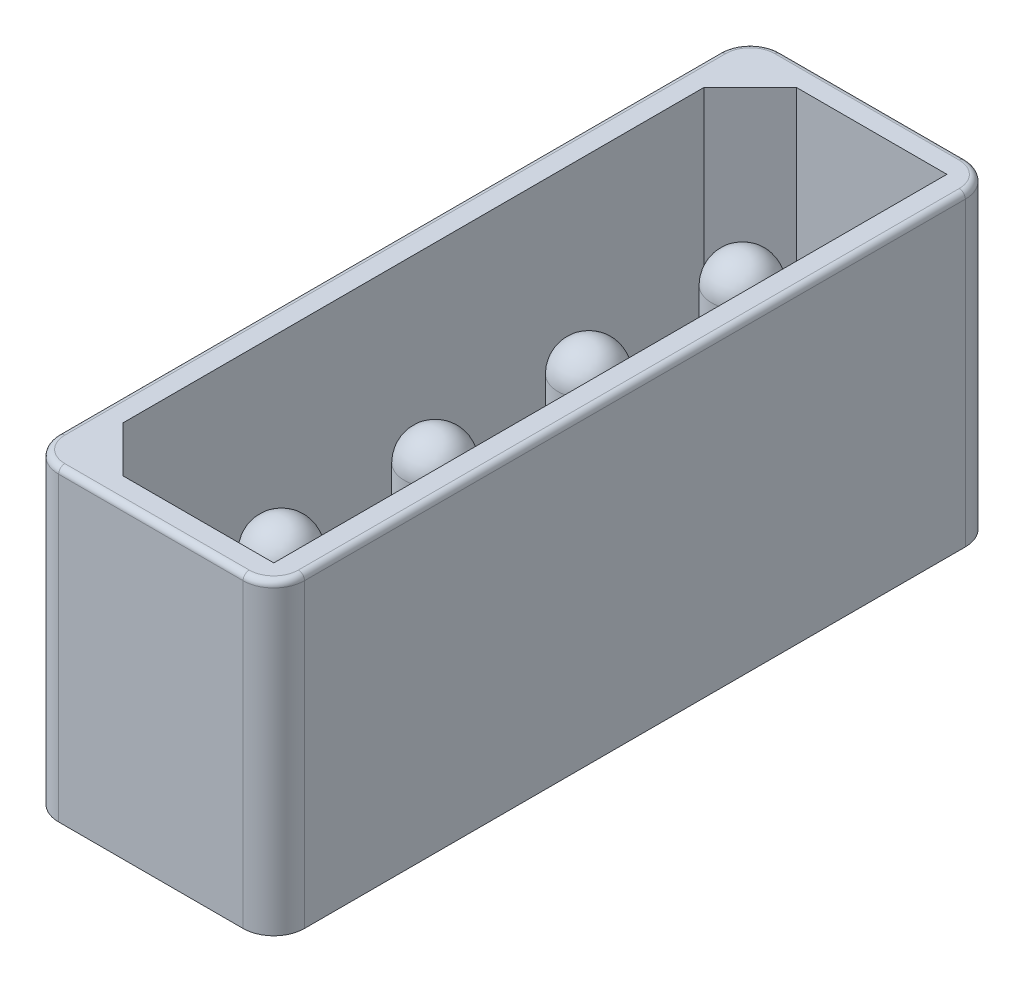
ISO-10303-21;
HEADER;
FILE_DESCRIPTION(('STEP AP214'),'2;1');
FILE_NAME('part.step','',(''),(''),'','','');
FILE_SCHEMA(('AUTOMOTIVE_DESIGN { 1 0 10303 214 1 1 1 1 }'));
ENDSEC;
DATA;
#1=APPLICATION_CONTEXT('core data for automotive mechanical design processes');
#2=APPLICATION_PROTOCOL_DEFINITION('international standard','automotive_design',2000,#1);
#3=PRODUCT_CONTEXT('',#1,'mechanical');
#4=PRODUCT('Part','Part','',(#3));
#5=PRODUCT_RELATED_PRODUCT_CATEGORY('part','',(#4));
#6=PRODUCT_DEFINITION_FORMATION('','',#4);
#7=PRODUCT_DEFINITION_CONTEXT('part definition',#1,'design');
#8=PRODUCT_DEFINITION('design','',#6,#7);
#9=PRODUCT_DEFINITION_SHAPE('','',#8);
#10=(LENGTH_UNIT() NAMED_UNIT(*) SI_UNIT(.MILLI.,.METRE.));
#11=(NAMED_UNIT(*) PLANE_ANGLE_UNIT() SI_UNIT($,.RADIAN.));
#12=(NAMED_UNIT(*) SI_UNIT($,.STERADIAN.) SOLID_ANGLE_UNIT());
#13=UNCERTAINTY_MEASURE_WITH_UNIT(LENGTH_MEASURE(1.E-05),#10,'distance_accuracy_value','');
#14=(GEOMETRIC_REPRESENTATION_CONTEXT(3) GLOBAL_UNCERTAINTY_ASSIGNED_CONTEXT((#13)) GLOBAL_UNIT_ASSIGNED_CONTEXT((#10,
#11,#12)) REPRESENTATION_CONTEXT('',''));
#15=CARTESIAN_POINT('',(0.,0.,0.));
#16=DIRECTION('',(0.,0.,1.));
#17=DIRECTION('',(1.,0.,0.));
#18=AXIS2_PLACEMENT_3D('',#15,#16,#17);
#19=CARTESIAN_POINT('',(-3.,1.5,10.75));
#20=DIRECTION('',(0.,-1.,0.));
#21=DIRECTION('',(0.,0.,-1.));
#22=AXIS2_PLACEMENT_3D('',#19,#20,#21);
#23=CYLINDRICAL_SURFACE('',#22,1.);
#24=CARTESIAN_POINT('',(-3.,1.,10.75));
#25=DIRECTION('',(0.,-1.,0.));
#26=DIRECTION('',(0.,0.,-1.));
#27=AXIS2_PLACEMENT_3D('',#24,#25,#26);
#28=CIRCLE('',#27,1.);
#29=CARTESIAN_POINT('',(-3.,1.,11.75));
#30=VERTEX_POINT('',#29);
#31=CARTESIAN_POINT('',(-4.,1.,10.75));
#32=VERTEX_POINT('',#31);
#33=EDGE_CURVE('E290',#30,#32,#28,.T.);
#34=ORIENTED_EDGE('',*,*,#33,.F.);
#35=DIRECTION('',(0.,-1.,0.));
#36=VECTOR('',#35,1.);
#37=CARTESIAN_POINT('',(-3.,1.5,11.75));
#38=LINE('',#37,#36);
#39=CARTESIAN_POINT('',(-3.,10.8,11.75));
#40=VERTEX_POINT('',#39);
#41=EDGE_CURVE('E12',#40,#30,#38,.T.);
#42=ORIENTED_EDGE('',*,*,#41,.F.);
#43=CARTESIAN_POINT('',(-3.,10.8,10.75));
#44=DIRECTION('',(0.,1.,0.));
#45=DIRECTION('',(0.,0.,1.));
#46=AXIS2_PLACEMENT_3D('',#43,#44,#45);
#47=CIRCLE('',#46,1.);
#48=CARTESIAN_POINT('',(-4.,10.8,10.75));
#49=VERTEX_POINT('',#48);
#50=EDGE_CURVE('E237',#40,#49,#47,.F.);
#51=ORIENTED_EDGE('',*,*,#50,.T.);
#52=DIRECTION('',(0.,-1.,0.));
#53=VECTOR('',#52,1.);
#54=CARTESIAN_POINT('',(-4.,1.5,10.75));
#55=LINE('',#54,#53);
#56=EDGE_CURVE('E52',#49,#32,#55,.T.);
#57=ORIENTED_EDGE('',*,*,#56,.T.);
#58=EDGE_LOOP('',(#34,#42,#51,#57));
#59=FACE_BOUND('',#58,.T.);
#60=ADVANCED_FACE('F49',(#59),#23,.T.);
#61=CARTESIAN_POINT('',(3.,1.5,11.75));
#62=DIRECTION('',(0.,0.,1.));
#63=DIRECTION('',(1.,0.,0.));
#64=AXIS2_PLACEMENT_3D('',#61,#62,#63);
#65=PLANE('',#64);
#66=DIRECTION('',(-1.,0.,0.));
#67=VECTOR('',#66,1.);
#68=CARTESIAN_POINT('',(3.,1.,11.75));
#69=LINE('',#68,#67);
#70=CARTESIAN_POINT('',(3.,1.,11.75));
#71=VERTEX_POINT('',#70);
#72=EDGE_CURVE('E311',#71,#30,#69,.T.);
#73=ORIENTED_EDGE('',*,*,#72,.F.);
#74=DIRECTION('',(0.,-1.,0.));
#75=VECTOR('',#74,1.);
#76=CARTESIAN_POINT('',(3.,1.5,11.75));
#77=LINE('',#76,#75);
#78=CARTESIAN_POINT('',(3.,10.8,11.75));
#79=VERTEX_POINT('',#78);
#80=EDGE_CURVE('E57',#79,#71,#77,.T.);
#81=ORIENTED_EDGE('',*,*,#80,.F.);
#82=DIRECTION('',(1.,0.,0.));
#83=VECTOR('',#82,1.);
#84=CARTESIAN_POINT('',(-3.,10.8,11.75));
#85=LINE('',#84,#83);
#86=EDGE_CURVE('E258',#79,#40,#85,.F.);
#87=ORIENTED_EDGE('',*,*,#86,.T.);
#88=ORIENTED_EDGE('',*,*,#41,.T.);
#89=EDGE_LOOP('',(#73,#81,#87,#88));
#90=FACE_BOUND('',#89,.T.);
#91=ADVANCED_FACE('F335',(#90),#65,.T.);
#92=CARTESIAN_POINT('',(3.,1.5,10.75));
#93=DIRECTION('',(0.,-1.,0.));
#94=DIRECTION('',(0.,0.,-1.));
#95=AXIS2_PLACEMENT_3D('',#92,#93,#94);
#96=CYLINDRICAL_SURFACE('',#95,1.);
#97=CARTESIAN_POINT('',(3.,1.,10.75));
#98=DIRECTION('',(0.,-1.,0.));
#99=DIRECTION('',(0.,0.,-1.));
#100=AXIS2_PLACEMENT_3D('',#97,#98,#99);
#101=CIRCLE('',#100,1.);
#102=CARTESIAN_POINT('',(4.,1.,10.75));
#103=VERTEX_POINT('',#102);
#104=EDGE_CURVE('E308',#103,#71,#101,.T.);
#105=ORIENTED_EDGE('',*,*,#104,.F.);
#106=DIRECTION('',(0.,-1.,0.));
#107=VECTOR('',#106,1.);
#108=CARTESIAN_POINT('',(4.,1.5,10.75));
#109=LINE('',#108,#107);
#110=CARTESIAN_POINT('',(4.,10.8,10.75));
#111=VERTEX_POINT('',#110);
#112=EDGE_CURVE('E315',#111,#103,#109,.T.);
#113=ORIENTED_EDGE('',*,*,#112,.F.);
#114=CARTESIAN_POINT('',(3.,10.8,10.75));
#115=DIRECTION('',(0.,1.,0.));
#116=DIRECTION('',(0.,0.,1.));
#117=AXIS2_PLACEMENT_3D('',#114,#115,#116);
#118=CIRCLE('',#117,1.);
#119=EDGE_CURVE('E255',#111,#79,#118,.F.);
#120=ORIENTED_EDGE('',*,*,#119,.T.);
#121=ORIENTED_EDGE('',*,*,#80,.T.);
#122=EDGE_LOOP('',(#105,#113,#120,#121));
#123=FACE_BOUND('',#122,.T.);
#124=ADVANCED_FACE('F382',(#123),#96,.T.);
#125=CARTESIAN_POINT('',(3.99999999999999,1.5,-10.75));
#126=DIRECTION('',(1.,0.,0.));
#127=DIRECTION('',(0.,0.,-1.));
#128=AXIS2_PLACEMENT_3D('',#125,#126,#127);
#129=PLANE('',#128);
#130=DIRECTION('',(0.,0.,1.));
#131=VECTOR('',#130,1.);
#132=CARTESIAN_POINT('',(3.99999999999999,1.,-10.75));
#133=LINE('',#132,#131);
#134=CARTESIAN_POINT('',(3.99999999999999,1.,-10.75));
#135=VERTEX_POINT('',#134);
#136=EDGE_CURVE('E305',#135,#103,#133,.T.);
#137=ORIENTED_EDGE('',*,*,#136,.F.);
#138=DIRECTION('',(0.,-1.,0.));
#139=VECTOR('',#138,1.);
#140=CARTESIAN_POINT('',(3.99999999999999,1.5,-10.75));
#141=LINE('',#140,#139);
#142=CARTESIAN_POINT('',(3.99999999999999,10.8,-10.75));
#143=VERTEX_POINT('',#142);
#144=EDGE_CURVE('E317',#143,#135,#141,.T.);
#145=ORIENTED_EDGE('',*,*,#144,.F.);
#146=DIRECTION('',(0.,0.,-1.));
#147=VECTOR('',#146,1.);
#148=CARTESIAN_POINT('',(4.,10.8,10.75));
#149=LINE('',#148,#147);
#150=EDGE_CURVE('E252',#143,#111,#149,.F.);
#151=ORIENTED_EDGE('',*,*,#150,.T.);
#152=ORIENTED_EDGE('',*,*,#112,.T.);
#153=EDGE_LOOP('',(#137,#145,#151,#152));
#154=FACE_BOUND('',#153,.T.);
#155=ADVANCED_FACE('F379',(#154),#129,.T.);
#156=CARTESIAN_POINT('',(2.99999999999999,1.5,-10.75));
#157=DIRECTION('',(0.,-1.,0.));
#158=DIRECTION('',(0.,0.,-1.));
#159=AXIS2_PLACEMENT_3D('',#156,#157,#158);
#160=CYLINDRICAL_SURFACE('',#159,1.);
#161=CARTESIAN_POINT('',(2.99999999999999,1.,-10.75));
#162=DIRECTION('',(0.,-1.,0.));
#163=DIRECTION('',(0.,0.,-1.));
#164=AXIS2_PLACEMENT_3D('',#161,#162,#163);
#165=CIRCLE('',#164,1.);
#166=CARTESIAN_POINT('',(2.99999999999999,1.,-11.75));
#167=VERTEX_POINT('',#166);
#168=EDGE_CURVE('E302',#167,#135,#165,.T.);
#169=ORIENTED_EDGE('',*,*,#168,.F.);
#170=DIRECTION('',(0.,-1.,0.));
#171=VECTOR('',#170,1.);
#172=CARTESIAN_POINT('',(2.99999999999999,1.5,-11.75));
#173=LINE('',#172,#171);
#174=CARTESIAN_POINT('',(2.99999999999999,10.8,-11.75));
#175=VERTEX_POINT('',#174);
#176=EDGE_CURVE('E319',#175,#167,#173,.T.);
#177=ORIENTED_EDGE('',*,*,#176,.F.);
#178=CARTESIAN_POINT('',(2.99999999999999,10.8,-10.75));
#179=DIRECTION('',(0.,1.,0.));
#180=DIRECTION('',(0.,0.,1.));
#181=AXIS2_PLACEMENT_3D('',#178,#179,#180);
#182=CIRCLE('',#181,1.);
#183=EDGE_CURVE('E249',#175,#143,#182,.F.);
#184=ORIENTED_EDGE('',*,*,#183,.T.);
#185=ORIENTED_EDGE('',*,*,#144,.T.);
#186=EDGE_LOOP('',(#169,#177,#184,#185));
#187=FACE_BOUND('',#186,.T.);
#188=ADVANCED_FACE('F376',(#187),#160,.T.);
#189=CARTESIAN_POINT('',(-3.,1.5,-11.75));
#190=DIRECTION('',(0.,0.,-1.));
#191=DIRECTION('',(-1.,0.,0.));
#192=AXIS2_PLACEMENT_3D('',#189,#190,#191);
#193=PLANE('',#192);
#194=DIRECTION('',(1.,0.,0.));
#195=VECTOR('',#194,1.);
#196=CARTESIAN_POINT('',(-3.,1.,-11.75));
#197=LINE('',#196,#195);
#198=CARTESIAN_POINT('',(-3.,1.,-11.75));
#199=VERTEX_POINT('',#198);
#200=EDGE_CURVE('E299',#199,#167,#197,.T.);
#201=ORIENTED_EDGE('',*,*,#200,.F.);
#202=DIRECTION('',(0.,-1.,0.));
#203=VECTOR('',#202,1.);
#204=CARTESIAN_POINT('',(-3.,1.5,-11.75));
#205=LINE('',#204,#203);
#206=CARTESIAN_POINT('',(-3.,10.8,-11.75));
#207=VERTEX_POINT('',#206);
#208=EDGE_CURVE('E321',#207,#199,#205,.T.);
#209=ORIENTED_EDGE('',*,*,#208,.F.);
#210=DIRECTION('',(-1.,0.,0.));
#211=VECTOR('',#210,1.);
#212=CARTESIAN_POINT('',(2.99999999999999,10.8,-11.75));
#213=LINE('',#212,#211);
#214=EDGE_CURVE('E246',#207,#175,#213,.F.);
#215=ORIENTED_EDGE('',*,*,#214,.T.);
#216=ORIENTED_EDGE('',*,*,#176,.T.);
#217=EDGE_LOOP('',(#201,#209,#215,#216));
#218=FACE_BOUND('',#217,.T.);
#219=ADVANCED_FACE('F368',(#218),#193,.T.);
#220=CARTESIAN_POINT('',(-3.,1.5,-10.75));
#221=DIRECTION('',(0.,-1.,0.));
#222=DIRECTION('',(0.,0.,-1.));
#223=AXIS2_PLACEMENT_3D('',#220,#221,#222);
#224=CYLINDRICAL_SURFACE('',#223,1.);
#225=CARTESIAN_POINT('',(-3.,1.,-10.75));
#226=DIRECTION('',(0.,-1.,0.));
#227=DIRECTION('',(0.,0.,-1.));
#228=AXIS2_PLACEMENT_3D('',#225,#226,#227);
#229=CIRCLE('',#228,1.);
#230=CARTESIAN_POINT('',(-4.,1.,-10.75));
#231=VERTEX_POINT('',#230);
#232=EDGE_CURVE('E296',#231,#199,#229,.T.);
#233=ORIENTED_EDGE('',*,*,#232,.F.);
#234=DIRECTION('',(0.,-1.,0.));
#235=VECTOR('',#234,1.);
#236=CARTESIAN_POINT('',(-4.,1.5,-10.75));
#237=LINE('',#236,#235);
#238=CARTESIAN_POINT('',(-4.,10.8,-10.75));
#239=VERTEX_POINT('',#238);
#240=EDGE_CURVE('E322',#239,#231,#237,.T.);
#241=ORIENTED_EDGE('',*,*,#240,.F.);
#242=CARTESIAN_POINT('',(-3.,10.8,-10.75));
#243=DIRECTION('',(0.,1.,0.));
#244=DIRECTION('',(0.,0.,1.));
#245=AXIS2_PLACEMENT_3D('',#242,#243,#244);
#246=CIRCLE('',#245,1.);
#247=EDGE_CURVE('E243',#239,#207,#246,.F.);
#248=ORIENTED_EDGE('',*,*,#247,.T.);
#249=ORIENTED_EDGE('',*,*,#208,.T.);
#250=EDGE_LOOP('',(#233,#241,#248,#249));
#251=FACE_BOUND('',#250,.T.);
#252=ADVANCED_FACE('F360',(#251),#224,.T.);
#253=CARTESIAN_POINT('',(-4.,1.5,10.75));
#254=DIRECTION('',(-1.,0.,0.));
#255=DIRECTION('',(0.,0.,1.));
#256=AXIS2_PLACEMENT_3D('',#253,#254,#255);
#257=PLANE('',#256);
#258=DIRECTION('',(0.,0.,-1.));
#259=VECTOR('',#258,1.);
#260=CARTESIAN_POINT('',(-4.,1.,10.75));
#261=LINE('',#260,#259);
#262=EDGE_CURVE('E293',#32,#231,#261,.T.);
#263=ORIENTED_EDGE('',*,*,#262,.F.);
#264=ORIENTED_EDGE('',*,*,#56,.F.);
#265=DIRECTION('',(0.,0.,1.));
#266=VECTOR('',#265,1.);
#267=CARTESIAN_POINT('',(-4.,10.8,-10.75));
#268=LINE('',#267,#266);
#269=EDGE_CURVE('E240',#49,#239,#268,.F.);
#270=ORIENTED_EDGE('',*,*,#269,.T.);
#271=ORIENTED_EDGE('',*,*,#240,.T.);
#272=EDGE_LOOP('',(#263,#264,#270,#271));
#273=FACE_BOUND('',#272,.T.);
#274=ADVANCED_FACE('F329',(#273),#257,.T.);
#275=CARTESIAN_POINT('',(-3.,1.,10.75));
#276=DIRECTION('',(0.,-1.,0.));
#277=DIRECTION('',(0.,0.,-1.));
#278=AXIS2_PLACEMENT_3D('',#275,#276,#277);
#279=PLANE('',#278);
#280=ORIENTED_EDGE('',*,*,#33,.T.);
#281=ORIENTED_EDGE('',*,*,#262,.T.);
#282=ORIENTED_EDGE('',*,*,#232,.T.);
#283=ORIENTED_EDGE('',*,*,#200,.T.);
#284=ORIENTED_EDGE('',*,*,#168,.T.);
#285=ORIENTED_EDGE('',*,*,#136,.T.);
#286=ORIENTED_EDGE('',*,*,#104,.T.);
#287=ORIENTED_EDGE('',*,*,#72,.T.);
#288=EDGE_LOOP('',(#280,#281,#282,#283,#284,#285,#286,#287));
#289=FACE_BOUND('',#288,.T.);
#290=ADVANCED_FACE('F331',(#289),#279,.T.);
#291=CARTESIAN_POINT('',(-3.2,11.,-10.95));
#292=DIRECTION('',(0.,0.,1.));
#293=DIRECTION('',(1.,0.,0.));
#294=AXIS2_PLACEMENT_3D('',#291,#292,#293);
#295=PLANE('',#294);
#296=DIRECTION('',(-1.,0.,0.));
#297=VECTOR('',#296,1.);
#298=CARTESIAN_POINT('',(-3.,1.5,-10.95));
#299=LINE('',#298,#297);
#300=CARTESIAN_POINT('',(3.2,1.5,-10.95));
#301=VERTEX_POINT('',#300);
#302=CARTESIAN_POINT('',(-1.69999999999999,1.5,-10.95));
#303=VERTEX_POINT('',#302);
#304=EDGE_CURVE('E191',#301,#303,#299,.T.);
#305=ORIENTED_EDGE('',*,*,#304,.F.);
#306=DIRECTION('',(0.,-1.,0.));
#307=VECTOR('',#306,1.);
#308=CARTESIAN_POINT('',(3.19999999999999,11.,-10.95));
#309=LINE('',#308,#307);
#310=CARTESIAN_POINT('',(3.19999999999999,11.,-10.95));
#311=VERTEX_POINT('',#310);
#312=EDGE_CURVE('E176',#311,#301,#309,.T.);
#313=ORIENTED_EDGE('',*,*,#312,.F.);
#314=DIRECTION('',(-1.,0.,0.));
#315=VECTOR('',#314,1.);
#316=CARTESIAN_POINT('',(-3.2,11.,-10.95));
#317=LINE('',#316,#315);
#318=CARTESIAN_POINT('',(-1.69999999999999,11.,-10.95));
#319=VERTEX_POINT('',#318);
#320=EDGE_CURVE('E189',#311,#319,#317,.T.);
#321=ORIENTED_EDGE('',*,*,#320,.T.);
#322=DIRECTION('',(0.,-1.,0.));
#323=VECTOR('',#322,1.);
#324=CARTESIAN_POINT('',(-1.69999999999999,0.,-10.95));
#325=LINE('',#324,#323);
#326=EDGE_CURVE('E215',#319,#303,#325,.T.);
#327=ORIENTED_EDGE('',*,*,#326,.T.);
#328=EDGE_LOOP('',(#305,#313,#321,#327));
#329=FACE_BOUND('',#328,.T.);
#330=ADVANCED_FACE('F187',(#329),#295,.T.);
#331=CARTESIAN_POINT('',(-3.2,11.,-10.95));
#332=DIRECTION('',(1.,0.,0.));
#333=DIRECTION('',(0.,0.,-1.));
#334=AXIS2_PLACEMENT_3D('',#331,#332,#333);
#335=PLANE('',#334);
#336=DIRECTION('',(0.,0.,1.));
#337=VECTOR('',#336,1.);
#338=CARTESIAN_POINT('',(-3.2,1.5,10.75));
#339=LINE('',#338,#337);
#340=CARTESIAN_POINT('',(-3.2,1.5,-9.45));
#341=VERTEX_POINT('',#340);
#342=CARTESIAN_POINT('',(-3.2,1.5,9.44999999999999));
#343=VERTEX_POINT('',#342);
#344=EDGE_CURVE('E287',#341,#343,#339,.T.);
#345=ORIENTED_EDGE('',*,*,#344,.F.);
#346=DIRECTION('',(0.,1.,0.));
#347=VECTOR('',#346,1.);
#348=CARTESIAN_POINT('',(-3.2,11.,-9.45));
#349=LINE('',#348,#347);
#350=CARTESIAN_POINT('',(-3.2,11.,-9.45));
#351=VERTEX_POINT('',#350);
#352=EDGE_CURVE('E208',#341,#351,#349,.T.);
#353=ORIENTED_EDGE('',*,*,#352,.T.);
#354=DIRECTION('',(0.,0.,1.));
#355=VECTOR('',#354,1.);
#356=CARTESIAN_POINT('',(-3.2,11.,-10.95));
#357=LINE('',#356,#355);
#358=CARTESIAN_POINT('',(-3.2,11.,9.44999999999999));
#359=VERTEX_POINT('',#358);
#360=EDGE_CURVE('E197',#351,#359,#357,.T.);
#361=ORIENTED_EDGE('',*,*,#360,.T.);
#362=DIRECTION('',(0.,-1.,0.));
#363=VECTOR('',#362,1.);
#364=CARTESIAN_POINT('',(-3.2,0.,9.44999999999999));
#365=LINE('',#364,#363);
#366=EDGE_CURVE('E210',#359,#343,#365,.T.);
#367=ORIENTED_EDGE('',*,*,#366,.T.);
#368=EDGE_LOOP('',(#345,#353,#361,#367));
#369=FACE_BOUND('',#368,.T.);
#370=ADVANCED_FACE('F423',(#369),#335,.T.);
#371=CARTESIAN_POINT('',(-3.2,11.,10.95));
#372=DIRECTION('',(0.,0.,-1.));
#373=DIRECTION('',(-1.,0.,0.));
#374=AXIS2_PLACEMENT_3D('',#371,#372,#373);
#375=PLANE('',#374);
#376=DIRECTION('',(1.,0.,0.));
#377=VECTOR('',#376,1.);
#378=CARTESIAN_POINT('',(-3.,1.5,10.95));
#379=LINE('',#378,#377);
#380=CARTESIAN_POINT('',(-1.70000000000001,1.5,10.95));
#381=VERTEX_POINT('',#380);
#382=CARTESIAN_POINT('',(3.2,1.5,10.95));
#383=VERTEX_POINT('',#382);
#384=EDGE_CURVE('E65',#381,#383,#379,.T.);
#385=ORIENTED_EDGE('',*,*,#384,.F.);
#386=DIRECTION('',(0.,1.,0.));
#387=VECTOR('',#386,1.);
#388=CARTESIAN_POINT('',(-1.70000000000001,11.,10.95));
#389=LINE('',#388,#387);
#390=CARTESIAN_POINT('',(-1.70000000000001,11.,10.95));
#391=VERTEX_POINT('',#390);
#392=EDGE_CURVE('E213',#381,#391,#389,.T.);
#393=ORIENTED_EDGE('',*,*,#392,.T.);
#394=DIRECTION('',(1.,0.,0.));
#395=VECTOR('',#394,1.);
#396=CARTESIAN_POINT('',(-3.2,11.,10.95));
#397=LINE('',#396,#395);
#398=CARTESIAN_POINT('',(3.2,11.,10.95));
#399=VERTEX_POINT('',#398);
#400=EDGE_CURVE('E182',#391,#399,#397,.T.);
#401=ORIENTED_EDGE('',*,*,#400,.T.);
#402=DIRECTION('',(0.,-1.,0.));
#403=VECTOR('',#402,1.);
#404=CARTESIAN_POINT('',(3.2,11.,10.95));
#405=LINE('',#404,#403);
#406=EDGE_CURVE('E178',#399,#383,#405,.T.);
#407=ORIENTED_EDGE('',*,*,#406,.T.);
#408=EDGE_LOOP('',(#385,#393,#401,#407));
#409=FACE_BOUND('',#408,.T.);
#410=ADVANCED_FACE('F428',(#409),#375,.T.);
#411=CARTESIAN_POINT('',(3.19999999999999,11.,-10.95));
#412=DIRECTION('',(-1.,0.,0.));
#413=DIRECTION('',(0.,0.,1.));
#414=AXIS2_PLACEMENT_3D('',#411,#412,#413);
#415=PLANE('',#414);
#416=DIRECTION('',(0.,0.,-1.));
#417=VECTOR('',#416,1.);
#418=CARTESIAN_POINT('',(3.2,1.5,10.75));
#419=LINE('',#418,#417);
#420=EDGE_CURVE('E284',#383,#301,#419,.T.);
#421=ORIENTED_EDGE('',*,*,#420,.F.);
#422=ORIENTED_EDGE('',*,*,#406,.F.);
#423=DIRECTION('',(0.,0.,-1.));
#424=VECTOR('',#423,1.);
#425=CARTESIAN_POINT('',(3.19999999999999,11.,-10.95));
#426=LINE('',#425,#424);
#427=EDGE_CURVE('E173',#399,#311,#426,.T.);
#428=ORIENTED_EDGE('',*,*,#427,.T.);
#429=ORIENTED_EDGE('',*,*,#312,.T.);
#430=EDGE_LOOP('',(#421,#422,#428,#429));
#431=FACE_BOUND('',#430,.T.);
#432=ADVANCED_FACE('F175',(#431),#415,.T.);
#433=CARTESIAN_POINT('',(-3.2,11.,9.44999999999999));
#434=DIRECTION('',(0.707106781186551,0.,-0.707106781186544));
#435=DIRECTION('',(-0.707106781186544,0.,-0.707106781186551));
#436=AXIS2_PLACEMENT_3D('',#433,#434,#435);
#437=PLANE('',#436);
#438=ORIENTED_EDGE('',*,*,#392,.F.);
#439=DIRECTION('',(0.707106781186544,0.,0.707106781186551));
#440=VECTOR('',#439,1.);
#441=CARTESIAN_POINT('',(-2.45,1.5,10.2));
#442=LINE('',#441,#440);
#443=EDGE_CURVE('E70',#381,#343,#442,.F.);
#444=ORIENTED_EDGE('',*,*,#443,.T.);
#445=ORIENTED_EDGE('',*,*,#366,.F.);
#446=DIRECTION('',(0.707106781186544,0.,0.707106781186551));
#447=VECTOR('',#446,1.);
#448=CARTESIAN_POINT('',(-3.2,11.,9.44999999999999));
#449=LINE('',#448,#447);
#450=EDGE_CURVE('E217',#391,#359,#449,.F.);
#451=ORIENTED_EDGE('',*,*,#450,.F.);
#452=EDGE_LOOP('',(#438,#444,#445,#451));
#453=FACE_BOUND('',#452,.T.);
#454=ADVANCED_FACE('F436',(#453),#437,.T.);
#455=CARTESIAN_POINT('',(-1.69999999999999,11.,-10.95));
#456=DIRECTION('',(0.707106781186543,0.,0.707106781186552));
#457=DIRECTION('',(0.707106781186552,0.,-0.707106781186543));
#458=AXIS2_PLACEMENT_3D('',#455,#456,#457);
#459=PLANE('',#458);
#460=ORIENTED_EDGE('',*,*,#352,.F.);
#461=DIRECTION('',(-0.707106781186552,0.,0.707106781186543));
#462=VECTOR('',#461,1.);
#463=CARTESIAN_POINT('',(-13.2,1.5,0.549999999999879));
#464=LINE('',#463,#462);
#465=EDGE_CURVE('E261',#341,#303,#464,.F.);
#466=ORIENTED_EDGE('',*,*,#465,.T.);
#467=ORIENTED_EDGE('',*,*,#326,.F.);
#468=DIRECTION('',(-0.707106781186552,0.,0.707106781186543));
#469=VECTOR('',#468,1.);
#470=CARTESIAN_POINT('',(-1.69999999999999,11.,-10.95));
#471=LINE('',#470,#469);
#472=EDGE_CURVE('E196',#351,#319,#471,.F.);
#473=ORIENTED_EDGE('',*,*,#472,.F.);
#474=EDGE_LOOP('',(#460,#466,#467,#473));
#475=FACE_BOUND('',#474,.T.);
#476=ADVANCED_FACE('F435',(#475),#459,.T.);
#477=CARTESIAN_POINT('',(-4.,11.,11.75));
#478=DIRECTION('',(0.,1.,0.));
#479=DIRECTION('',(0.,0.,1.));
#480=AXIS2_PLACEMENT_3D('',#477,#478,#479);
#481=PLANE('',#480);
#482=DIRECTION('',(0.,0.,1.));
#483=VECTOR('',#482,1.);
#484=CARTESIAN_POINT('',(-3.8,11.,10.75));
#485=LINE('',#484,#483);
#486=CARTESIAN_POINT('',(-3.8,11.,-10.75));
#487=VERTEX_POINT('',#486);
#488=CARTESIAN_POINT('',(-3.8,11.,10.75));
#489=VERTEX_POINT('',#488);
#490=EDGE_CURVE('E232',#487,#489,#485,.T.);
#491=ORIENTED_EDGE('',*,*,#490,.T.);
#492=CARTESIAN_POINT('',(-3.,11.,10.75));
#493=DIRECTION('',(0.,1.,0.));
#494=DIRECTION('',(0.,0.,1.));
#495=AXIS2_PLACEMENT_3D('',#492,#493,#494);
#496=CIRCLE('',#495,0.8);
#497=CARTESIAN_POINT('',(-3.,11.,11.55));
#498=VERTEX_POINT('',#497);
#499=EDGE_CURVE('E234',#489,#498,#496,.T.);
#500=ORIENTED_EDGE('',*,*,#499,.T.);
#501=DIRECTION('',(1.,0.,0.));
#502=VECTOR('',#501,1.);
#503=CARTESIAN_POINT('',(3.,11.,11.55));
#504=LINE('',#503,#502);
#505=CARTESIAN_POINT('',(3.,11.,11.55));
#506=VERTEX_POINT('',#505);
#507=EDGE_CURVE('E220',#498,#506,#504,.T.);
#508=ORIENTED_EDGE('',*,*,#507,.T.);
#509=CARTESIAN_POINT('',(3.,11.,10.75));
#510=DIRECTION('',(0.,1.,0.));
#511=DIRECTION('',(0.,0.,1.));
#512=AXIS2_PLACEMENT_3D('',#509,#510,#511);
#513=CIRCLE('',#512,0.8);
#514=CARTESIAN_POINT('',(3.8,11.,10.75));
#515=VERTEX_POINT('',#514);
#516=EDGE_CURVE('E222',#506,#515,#513,.T.);
#517=ORIENTED_EDGE('',*,*,#516,.T.);
#518=DIRECTION('',(0.,0.,-1.));
#519=VECTOR('',#518,1.);
#520=CARTESIAN_POINT('',(3.79999999999999,11.,-10.75));
#521=LINE('',#520,#519);
#522=CARTESIAN_POINT('',(3.79999999999999,11.,-10.75));
#523=VERTEX_POINT('',#522);
#524=EDGE_CURVE('E224',#515,#523,#521,.T.);
#525=ORIENTED_EDGE('',*,*,#524,.T.);
#526=CARTESIAN_POINT('',(2.99999999999999,11.,-10.75));
#527=DIRECTION('',(0.,1.,0.));
#528=DIRECTION('',(0.,0.,1.));
#529=AXIS2_PLACEMENT_3D('',#526,#527,#528);
#530=CIRCLE('',#529,0.8);
#531=CARTESIAN_POINT('',(2.99999999999999,11.,-11.55));
#532=VERTEX_POINT('',#531);
#533=EDGE_CURVE('E226',#523,#532,#530,.T.);
#534=ORIENTED_EDGE('',*,*,#533,.T.);
#535=DIRECTION('',(-1.,0.,0.));
#536=VECTOR('',#535,1.);
#537=CARTESIAN_POINT('',(-3.,11.,-11.55));
#538=LINE('',#537,#536);
#539=CARTESIAN_POINT('',(-3.,11.,-11.55));
#540=VERTEX_POINT('',#539);
#541=EDGE_CURVE('E228',#532,#540,#538,.T.);
#542=ORIENTED_EDGE('',*,*,#541,.T.);
#543=CARTESIAN_POINT('',(-3.,11.,-10.75));
#544=DIRECTION('',(0.,1.,0.));
#545=DIRECTION('',(0.,0.,1.));
#546=AXIS2_PLACEMENT_3D('',#543,#544,#545);
#547=CIRCLE('',#546,0.8);
#548=EDGE_CURVE('E230',#540,#487,#547,.T.);
#549=ORIENTED_EDGE('',*,*,#548,.T.);
#550=EDGE_LOOP('',(#491,#500,#508,#517,#525,#534,#542,#549));
#551=FACE_BOUND('',#550,.T.);
#552=ORIENTED_EDGE('',*,*,#360,.F.);
#553=ORIENTED_EDGE('',*,*,#472,.T.);
#554=ORIENTED_EDGE('',*,*,#320,.F.);
#555=ORIENTED_EDGE('',*,*,#427,.F.);
#556=ORIENTED_EDGE('',*,*,#400,.F.);
#557=ORIENTED_EDGE('',*,*,#450,.T.);
#558=EDGE_LOOP('',(#552,#553,#554,#555,#556,#557));
#559=FACE_BOUND('',#558,.T.);
#560=ADVANCED_FACE('F194',(#551,#559),#481,.T.);
#561=CARTESIAN_POINT('',(2.99999999999999,10.8,-10.75));
#562=DIRECTION('',(0.,1.,0.));
#563=DIRECTION('',(0.,0.,1.));
#564=AXIS2_PLACEMENT_3D('',#561,#562,#563);
#565=TOROIDAL_SURFACE('',#564,0.8,0.2);
#566=CARTESIAN_POINT('',(3.79999999999999,10.8,-10.75));
#567=DIRECTION('',(0.,0.,1.));
#568=DIRECTION('',(1.,0.,0.));
#569=AXIS2_PLACEMENT_3D('',#566,#567,#568);
#570=CIRCLE('',#569,0.2);
#571=EDGE_CURVE('E203',#143,#523,#570,.T.);
#572=ORIENTED_EDGE('',*,*,#571,.F.);
#573=ORIENTED_EDGE('',*,*,#183,.F.);
#574=CARTESIAN_POINT('',(2.99999999999999,10.8,-11.55));
#575=DIRECTION('',(-1.,0.,0.));
#576=DIRECTION('',(0.,0.,1.));
#577=AXIS2_PLACEMENT_3D('',#574,#575,#576);
#578=CIRCLE('',#577,0.2);
#579=EDGE_CURVE('E198',#532,#175,#578,.T.);
#580=ORIENTED_EDGE('',*,*,#579,.F.);
#581=ORIENTED_EDGE('',*,*,#533,.F.);
#582=EDGE_LOOP('',(#572,#573,#580,#581));
#583=FACE_BOUND('',#582,.T.);
#584=ADVANCED_FACE('F372',(#583),#565,.T.);
#585=CARTESIAN_POINT('',(-4.,10.8,-11.55));
#586=DIRECTION('',(1.,0.,0.));
#587=DIRECTION('',(0.,0.,-1.));
#588=AXIS2_PLACEMENT_3D('',#585,#586,#587);
#589=CYLINDRICAL_SURFACE('',#588,0.2);
#590=ORIENTED_EDGE('',*,*,#579,.T.);
#591=ORIENTED_EDGE('',*,*,#214,.F.);
#592=CARTESIAN_POINT('',(-3.,10.8,-11.55));
#593=DIRECTION('',(-1.,0.,0.));
#594=DIRECTION('',(0.,0.,1.));
#595=AXIS2_PLACEMENT_3D('',#592,#593,#594);
#596=CIRCLE('',#595,0.2);
#597=EDGE_CURVE('E276',#540,#207,#596,.T.);
#598=ORIENTED_EDGE('',*,*,#597,.F.);
#599=ORIENTED_EDGE('',*,*,#541,.F.);
#600=EDGE_LOOP('',(#590,#591,#598,#599));
#601=FACE_BOUND('',#600,.T.);
#602=ADVANCED_FACE('F363',(#601),#589,.T.);
#603=CARTESIAN_POINT('',(3.8,10.8,11.75));
#604=DIRECTION('',(0.,0.,1.));
#605=DIRECTION('',(1.,0.,0.));
#606=AXIS2_PLACEMENT_3D('',#603,#604,#605);
#607=CYLINDRICAL_SURFACE('',#606,0.2);
#608=ORIENTED_EDGE('',*,*,#571,.T.);
#609=ORIENTED_EDGE('',*,*,#524,.F.);
#610=CARTESIAN_POINT('',(3.8,10.8,10.75));
#611=DIRECTION('',(0.,0.,1.));
#612=DIRECTION('',(1.,0.,0.));
#613=AXIS2_PLACEMENT_3D('',#610,#611,#612);
#614=CIRCLE('',#613,0.2);
#615=EDGE_CURVE('E273',#111,#515,#614,.T.);
#616=ORIENTED_EDGE('',*,*,#615,.F.);
#617=ORIENTED_EDGE('',*,*,#150,.F.);
#618=EDGE_LOOP('',(#608,#609,#616,#617));
#619=FACE_BOUND('',#618,.T.);
#620=ADVANCED_FACE('F388',(#619),#607,.T.);
#621=CARTESIAN_POINT('',(-3.,10.8,-10.75));
#622=DIRECTION('',(0.,1.,0.));
#623=DIRECTION('',(0.,0.,1.));
#624=AXIS2_PLACEMENT_3D('',#621,#622,#623);
#625=TOROIDAL_SURFACE('',#624,0.8,0.2);
#626=ORIENTED_EDGE('',*,*,#597,.T.);
#627=ORIENTED_EDGE('',*,*,#247,.F.);
#628=CARTESIAN_POINT('',(-3.8,10.8,-10.75));
#629=DIRECTION('',(0.,0.,1.));
#630=DIRECTION('',(1.,0.,0.));
#631=AXIS2_PLACEMENT_3D('',#628,#629,#630);
#632=CIRCLE('',#631,0.2);
#633=EDGE_CURVE('E270',#487,#239,#632,.T.);
#634=ORIENTED_EDGE('',*,*,#633,.F.);
#635=ORIENTED_EDGE('',*,*,#548,.F.);
#636=EDGE_LOOP('',(#626,#627,#634,#635));
#637=FACE_BOUND('',#636,.T.);
#638=ADVANCED_FACE('F356',(#637),#625,.T.);
#639=CARTESIAN_POINT('',(3.,10.8,10.75));
#640=DIRECTION('',(0.,1.,0.));
#641=DIRECTION('',(0.,0.,1.));
#642=AXIS2_PLACEMENT_3D('',#639,#640,#641);
#643=TOROIDAL_SURFACE('',#642,0.8,0.2);
#644=ORIENTED_EDGE('',*,*,#615,.T.);
#645=ORIENTED_EDGE('',*,*,#516,.F.);
#646=CARTESIAN_POINT('',(3.,10.8,11.55));
#647=DIRECTION('',(-1.,0.,0.));
#648=DIRECTION('',(0.,0.,1.));
#649=AXIS2_PLACEMENT_3D('',#646,#647,#648);
#650=CIRCLE('',#649,0.2);
#651=EDGE_CURVE('E267',#79,#506,#650,.T.);
#652=ORIENTED_EDGE('',*,*,#651,.F.);
#653=ORIENTED_EDGE('',*,*,#119,.F.);
#654=EDGE_LOOP('',(#644,#645,#652,#653));
#655=FACE_BOUND('',#654,.T.);
#656=ADVANCED_FACE('F385',(#655),#643,.T.);
#657=CARTESIAN_POINT('',(-3.8,10.8,11.75));
#658=DIRECTION('',(0.,0.,-1.));
#659=DIRECTION('',(-1.,0.,0.));
#660=AXIS2_PLACEMENT_3D('',#657,#658,#659);
#661=CYLINDRICAL_SURFACE('',#660,0.2);
#662=ORIENTED_EDGE('',*,*,#633,.T.);
#663=ORIENTED_EDGE('',*,*,#269,.F.);
#664=CARTESIAN_POINT('',(-3.8,10.8,10.75));
#665=DIRECTION('',(0.,0.,1.));
#666=DIRECTION('',(1.,0.,0.));
#667=AXIS2_PLACEMENT_3D('',#664,#665,#666);
#668=CIRCLE('',#667,0.2);
#669=EDGE_CURVE('E264',#489,#49,#668,.T.);
#670=ORIENTED_EDGE('',*,*,#669,.F.);
#671=ORIENTED_EDGE('',*,*,#490,.F.);
#672=EDGE_LOOP('',(#662,#663,#670,#671));
#673=FACE_BOUND('',#672,.T.);
#674=ADVANCED_FACE('F353',(#673),#661,.T.);
#675=CARTESIAN_POINT('',(-4.,10.8,11.55));
#676=DIRECTION('',(-1.,0.,0.));
#677=DIRECTION('',(0.,0.,1.));
#678=AXIS2_PLACEMENT_3D('',#675,#676,#677);
#679=CYLINDRICAL_SURFACE('',#678,0.2);
#680=ORIENTED_EDGE('',*,*,#651,.T.);
#681=ORIENTED_EDGE('',*,*,#507,.F.);
#682=CARTESIAN_POINT('',(-3.,10.8,11.55));
#683=DIRECTION('',(-1.,0.,0.));
#684=DIRECTION('',(0.,0.,1.));
#685=AXIS2_PLACEMENT_3D('',#682,#683,#684);
#686=CIRCLE('',#685,0.2);
#687=EDGE_CURVE('E262',#40,#498,#686,.T.);
#688=ORIENTED_EDGE('',*,*,#687,.F.);
#689=ORIENTED_EDGE('',*,*,#86,.F.);
#690=EDGE_LOOP('',(#680,#681,#688,#689));
#691=FACE_BOUND('',#690,.T.);
#692=ADVANCED_FACE('F345',(#691),#679,.T.);
#693=CARTESIAN_POINT('',(-3.,10.8,10.75));
#694=DIRECTION('',(0.,1.,0.));
#695=DIRECTION('',(0.,0.,1.));
#696=AXIS2_PLACEMENT_3D('',#693,#694,#695);
#697=TOROIDAL_SURFACE('',#696,0.8,0.2);
#698=ORIENTED_EDGE('',*,*,#669,.T.);
#699=ORIENTED_EDGE('',*,*,#50,.F.);
#700=ORIENTED_EDGE('',*,*,#687,.T.);
#701=ORIENTED_EDGE('',*,*,#499,.F.);
#702=EDGE_LOOP('',(#698,#699,#700,#701));
#703=FACE_BOUND('',#702,.T.);
#704=ADVANCED_FACE('F340',(#703),#697,.T.);
#705=CARTESIAN_POINT('',(-3.,1.5,10.75));
#706=DIRECTION('',(0.,-1.,0.));
#707=DIRECTION('',(0.,0.,-1.));
#708=AXIS2_PLACEMENT_3D('',#705,#706,#707);
#709=PLANE('',#708);
#710=ORIENTED_EDGE('',*,*,#443,.F.);
#711=ORIENTED_EDGE('',*,*,#384,.T.);
#712=ORIENTED_EDGE('',*,*,#420,.T.);
#713=ORIENTED_EDGE('',*,*,#304,.T.);
#714=ORIENTED_EDGE('',*,*,#465,.F.);
#715=ORIENTED_EDGE('',*,*,#344,.T.);
#716=EDGE_LOOP('',(#710,#711,#712,#713,#714,#715));
#717=FACE_BOUND('',#716,.T.);
#718=ADVANCED_FACE('F445',(#717),#709,.F.);
#719=CLOSED_SHELL('',(#60,#91,#124,#155,#188,#219,#252,#274,#290,#330,#370,#410,#432,#454,#476,
#560,#584,#602,#620,#638,#656,#674,#692,#704,#718));
#720=MANIFOLD_SOLID_BREP('B2',#719);
#721=CARTESIAN_POINT('',(-1.57116751249922E-13,9.,-7.5));
#722=DIRECTION('',(0.,-1.,0.));
#723=DIRECTION('',(0.,0.,-1.));
#724=AXIS2_PLACEMENT_3D('',#721,#722,#723);
#725=CYLINDRICAL_SURFACE('',#724,1.);
#726=CARTESIAN_POINT('',(-1.57116751249922E-13,8.,-7.5));
#727=DIRECTION('',(0.,-1.,0.));
#728=DIRECTION('',(0.,0.,-1.));
#729=AXIS2_PLACEMENT_3D('',#726,#727,#728);
#730=CIRCLE('',#729,1.);
#731=CARTESIAN_POINT('',(-1.57116751249922E-13,8.,-8.5));
#732=VERTEX_POINT('',#731);
#733=EDGE_CURVE('E48',#732,#732,#730,.T.);
#734=ORIENTED_EDGE('',*,*,#733,.T.);
#735=EDGE_LOOP('',(#734));
#736=FACE_BOUND('',#735,.T.);
#737=CARTESIAN_POINT('',(-1.57116751249922E-13,1.,-7.5));
#738=DIRECTION('',(0.,1.,0.));
#739=DIRECTION('',(0.,0.,1.));
#740=AXIS2_PLACEMENT_3D('',#737,#738,#739);
#741=CIRCLE('',#740,1.);
#742=CARTESIAN_POINT('',(-1.57116751249922E-13,1.,-6.5));
#743=VERTEX_POINT('',#742);
#744=EDGE_CURVE('E667',#743,#743,#741,.T.);
#745=ORIENTED_EDGE('',*,*,#744,.T.);
#746=EDGE_LOOP('',(#745));
#747=FACE_BOUND('',#746,.T.);
#748=ADVANCED_FACE('F660',(#736,#747),#725,.T.);
#749=CARTESIAN_POINT('',(-1.57116751249922E-13,1.,-7.5));
#750=DIRECTION('',(0.,1.,0.));
#751=DIRECTION('',(0.,0.,1.));
#752=AXIS2_PLACEMENT_3D('',#749,#750,#751);
#753=PLANE('',#752);
#754=ORIENTED_EDGE('',*,*,#744,.F.);
#755=EDGE_LOOP('',(#754));
#756=FACE_BOUND('',#755,.T.);
#757=ADVANCED_FACE('F674',(#756),#753,.F.);
#758=CARTESIAN_POINT('',(-1.57116751249922E-13,8.,-7.5));
#759=DIRECTION('',(0.,0.,1.));
#760=DIRECTION('',(1.,0.,0.));
#761=AXIS2_PLACEMENT_3D('',#758,#759,#760);
#762=SPHERICAL_SURFACE('',#761,1.);
#763=CARTESIAN_POINT('',(-1.57116751249922E-13,8.,-7.5));
#764=DIRECTION('',(0.,-1.,0.));
#765=DIRECTION('',(0.,0.,-1.));
#766=AXIS2_PLACEMENT_3D('',#763,#764,#765);
#767=SPHERICAL_SURFACE('',#766,1.);
#768=ORIENTED_EDGE('',*,*,#733,.F.);
#769=EDGE_LOOP('',(#768));
#770=FACE_BOUND('',#769,.T.);
#771=ADVANCED_FACE('F662',(#770),#767,.T.);
#772=CLOSED_SHELL('',(#748,#757,#771));
#773=MANIFOLD_SOLID_BREP('B6',#772);
#774=CARTESIAN_POINT('',(-1.04744500833281E-13,9.,-2.5));
#775=DIRECTION('',(0.,-1.,0.));
#776=DIRECTION('',(0.,0.,-1.));
#777=AXIS2_PLACEMENT_3D('',#774,#775,#776);
#778=CYLINDRICAL_SURFACE('',#777,1.);
#779=CARTESIAN_POINT('',(-1.04744500833281E-13,8.,-2.5));
#780=DIRECTION('',(0.,-1.,0.));
#781=DIRECTION('',(0.,0.,-1.));
#782=AXIS2_PLACEMENT_3D('',#779,#780,#781);
#783=CIRCLE('',#782,1.);
#784=CARTESIAN_POINT('',(-1.04744500833281E-13,8.,-3.5));
#785=VERTEX_POINT('',#784);
#786=EDGE_CURVE('E659',#785,#785,#783,.T.);
#787=ORIENTED_EDGE('',*,*,#786,.T.);
#788=EDGE_LOOP('',(#787));
#789=FACE_BOUND('',#788,.T.);
#790=CARTESIAN_POINT('',(-1.04744500833281E-13,1.,-2.5));
#791=DIRECTION('',(0.,1.,0.));
#792=DIRECTION('',(0.,0.,1.));
#793=AXIS2_PLACEMENT_3D('',#790,#791,#792);
#794=CIRCLE('',#793,1.);
#795=CARTESIAN_POINT('',(-1.04744500833281E-13,1.,-1.5));
#796=VERTEX_POINT('',#795);
#797=EDGE_CURVE('E715',#796,#796,#794,.T.);
#798=ORIENTED_EDGE('',*,*,#797,.T.);
#799=EDGE_LOOP('',(#798));
#800=FACE_BOUND('',#799,.T.);
#801=ADVANCED_FACE('F708',(#789,#800),#778,.T.);
#802=CARTESIAN_POINT('',(-1.04744500833281E-13,1.,-2.5));
#803=DIRECTION('',(0.,1.,0.));
#804=DIRECTION('',(0.,0.,1.));
#805=AXIS2_PLACEMENT_3D('',#802,#803,#804);
#806=PLANE('',#805);
#807=ORIENTED_EDGE('',*,*,#797,.F.);
#808=EDGE_LOOP('',(#807));
#809=FACE_BOUND('',#808,.T.);
#810=ADVANCED_FACE('F722',(#809),#806,.F.);
#811=CARTESIAN_POINT('',(-1.04744500833281E-13,8.,-2.5));
#812=DIRECTION('',(0.,0.,1.));
#813=DIRECTION('',(1.,0.,0.));
#814=AXIS2_PLACEMENT_3D('',#811,#812,#813);
#815=SPHERICAL_SURFACE('',#814,1.);
#816=CARTESIAN_POINT('',(-1.04744500833281E-13,8.,-2.5));
#817=DIRECTION('',(0.,-1.,0.));
#818=DIRECTION('',(0.,0.,-1.));
#819=AXIS2_PLACEMENT_3D('',#816,#817,#818);
#820=SPHERICAL_SURFACE('',#819,1.);
#821=ORIENTED_EDGE('',*,*,#786,.F.);
#822=EDGE_LOOP('',(#821));
#823=FACE_BOUND('',#822,.T.);
#824=ADVANCED_FACE('F710',(#823),#820,.T.);
#825=CLOSED_SHELL('',(#801,#810,#824));
#826=MANIFOLD_SOLID_BREP('B43',#825);
#827=CARTESIAN_POINT('',(0.,9.,2.5));
#828=DIRECTION('',(0.,-1.,0.));
#829=DIRECTION('',(0.,0.,-1.));
#830=AXIS2_PLACEMENT_3D('',#827,#828,#829);
#831=CYLINDRICAL_SURFACE('',#830,1.);
#832=CARTESIAN_POINT('',(0.,8.,2.5));
#833=DIRECTION('',(0.,-1.,0.));
#834=DIRECTION('',(0.,0.,-1.));
#835=AXIS2_PLACEMENT_3D('',#832,#833,#834);
#836=CIRCLE('',#835,1.);
#837=CARTESIAN_POINT('',(0.,8.,1.5));
#838=VERTEX_POINT('',#837);
#839=EDGE_CURVE('E707',#838,#838,#836,.T.);
#840=ORIENTED_EDGE('',*,*,#839,.T.);
#841=EDGE_LOOP('',(#840));
#842=FACE_BOUND('',#841,.T.);
#843=CARTESIAN_POINT('',(0.,1.,2.5));
#844=DIRECTION('',(0.,1.,0.));
#845=DIRECTION('',(0.,0.,1.));
#846=AXIS2_PLACEMENT_3D('',#843,#844,#845);
#847=CIRCLE('',#846,1.);
#848=CARTESIAN_POINT('',(0.,1.,3.5));
#849=VERTEX_POINT('',#848);
#850=EDGE_CURVE('E762',#849,#849,#847,.T.);
#851=ORIENTED_EDGE('',*,*,#850,.T.);
#852=EDGE_LOOP('',(#851));
#853=FACE_BOUND('',#852,.T.);
#854=ADVANCED_FACE('F755',(#842,#853),#831,.T.);
#855=CARTESIAN_POINT('',(0.,1.,2.5));
#856=DIRECTION('',(0.,1.,0.));
#857=DIRECTION('',(0.,0.,1.));
#858=AXIS2_PLACEMENT_3D('',#855,#856,#857);
#859=PLANE('',#858);
#860=ORIENTED_EDGE('',*,*,#850,.F.);
#861=EDGE_LOOP('',(#860));
#862=FACE_BOUND('',#861,.T.);
#863=ADVANCED_FACE('F769',(#862),#859,.F.);
#864=CARTESIAN_POINT('',(0.,8.,2.5));
#865=DIRECTION('',(0.,0.,1.));
#866=DIRECTION('',(1.,0.,0.));
#867=AXIS2_PLACEMENT_3D('',#864,#865,#866);
#868=SPHERICAL_SURFACE('',#867,1.);
#869=CARTESIAN_POINT('',(0.,8.,2.5));
#870=DIRECTION('',(0.,-1.,0.));
#871=DIRECTION('',(0.,0.,-1.));
#872=AXIS2_PLACEMENT_3D('',#869,#870,#871);
#873=SPHERICAL_SURFACE('',#872,1.);
#874=ORIENTED_EDGE('',*,*,#839,.F.);
#875=EDGE_LOOP('',(#874));
#876=FACE_BOUND('',#875,.T.);
#877=ADVANCED_FACE('F757',(#876),#873,.T.);
#878=CLOSED_SHELL('',(#854,#863,#877));
#879=MANIFOLD_SOLID_BREP('B654',#878);
#880=CARTESIAN_POINT('',(0.,9.,7.5));
#881=DIRECTION('',(0.,-1.,0.));
#882=DIRECTION('',(0.,0.,-1.));
#883=AXIS2_PLACEMENT_3D('',#880,#881,#882);
#884=CYLINDRICAL_SURFACE('',#883,1.);
#885=CARTESIAN_POINT('',(0.,8.,7.5));
#886=DIRECTION('',(0.,-1.,0.));
#887=DIRECTION('',(0.,0.,-1.));
#888=AXIS2_PLACEMENT_3D('',#885,#886,#887);
#889=CIRCLE('',#888,1.);
#890=CARTESIAN_POINT('',(0.,8.,6.5));
#891=VERTEX_POINT('',#890);
#892=EDGE_CURVE('E754',#891,#891,#889,.T.);
#893=ORIENTED_EDGE('',*,*,#892,.T.);
#894=EDGE_LOOP('',(#893));
#895=FACE_BOUND('',#894,.T.);
#896=CARTESIAN_POINT('',(0.,1.,7.5));
#897=DIRECTION('',(0.,1.,0.));
#898=DIRECTION('',(0.,0.,1.));
#899=AXIS2_PLACEMENT_3D('',#896,#897,#898);
#900=CIRCLE('',#899,1.);
#901=CARTESIAN_POINT('',(0.,1.,8.5));
#902=VERTEX_POINT('',#901);
#903=EDGE_CURVE('E802',#902,#902,#900,.T.);
#904=ORIENTED_EDGE('',*,*,#903,.T.);
#905=EDGE_LOOP('',(#904));
#906=FACE_BOUND('',#905,.T.);
#907=ADVANCED_FACE('F795',(#895,#906),#884,.T.);
#908=CARTESIAN_POINT('',(0.,1.,7.5));
#909=DIRECTION('',(0.,1.,0.));
#910=DIRECTION('',(0.,0.,1.));
#911=AXIS2_PLACEMENT_3D('',#908,#909,#910);
#912=PLANE('',#911);
#913=ORIENTED_EDGE('',*,*,#903,.F.);
#914=EDGE_LOOP('',(#913));
#915=FACE_BOUND('',#914,.T.);
#916=ADVANCED_FACE('F809',(#915),#912,.F.);
#917=CARTESIAN_POINT('',(0.,8.,7.5));
#918=DIRECTION('',(0.,0.,1.));
#919=DIRECTION('',(1.,0.,0.));
#920=AXIS2_PLACEMENT_3D('',#917,#918,#919);
#921=SPHERICAL_SURFACE('',#920,1.);
#922=CARTESIAN_POINT('',(0.,8.,7.5));
#923=DIRECTION('',(0.,-1.,0.));
#924=DIRECTION('',(0.,0.,-1.));
#925=AXIS2_PLACEMENT_3D('',#922,#923,#924);
#926=SPHERICAL_SURFACE('',#925,1.);
#927=ORIENTED_EDGE('',*,*,#892,.F.);
#928=EDGE_LOOP('',(#927));
#929=FACE_BOUND('',#928,.T.);
#930=ADVANCED_FACE('F797',(#929),#926,.T.);
#931=CLOSED_SHELL('',(#907,#916,#930));
#932=MANIFOLD_SOLID_BREP('B702',#931);
#933=ADVANCED_BREP_SHAPE_REPRESENTATION('',(#18,#720,#773,#826,#879,#932),#14);
#934=SHAPE_DEFINITION_REPRESENTATION(#9,#933);
ENDSEC;
END-ISO-10303-21;
